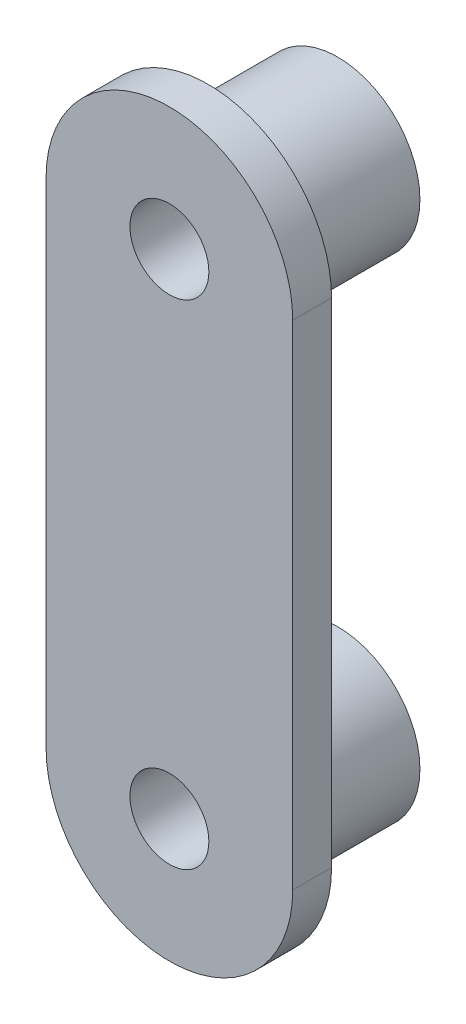
ISO-10303-21;
HEADER;
FILE_DESCRIPTION(('STEP AP214'),'2;1');
FILE_NAME('part.step','',(''),(''),'','','');
FILE_SCHEMA(('AUTOMOTIVE_DESIGN { 1 0 10303 214 1 1 1 1 }'));
ENDSEC;
DATA;
#1=APPLICATION_CONTEXT('core data for automotive mechanical design processes');
#2=APPLICATION_PROTOCOL_DEFINITION('international standard','automotive_design',2000,#1);
#3=PRODUCT_CONTEXT('',#1,'mechanical');
#4=PRODUCT('Part','Part','',(#3));
#5=PRODUCT_RELATED_PRODUCT_CATEGORY('part','',(#4));
#6=PRODUCT_DEFINITION_FORMATION('','',#4);
#7=PRODUCT_DEFINITION_CONTEXT('part definition',#1,'design');
#8=PRODUCT_DEFINITION('design','',#6,#7);
#9=PRODUCT_DEFINITION_SHAPE('','',#8);
#10=(LENGTH_UNIT() NAMED_UNIT(*) SI_UNIT(.MILLI.,.METRE.));
#11=(NAMED_UNIT(*) PLANE_ANGLE_UNIT() SI_UNIT($,.RADIAN.));
#12=(NAMED_UNIT(*) SI_UNIT($,.STERADIAN.) SOLID_ANGLE_UNIT());
#13=UNCERTAINTY_MEASURE_WITH_UNIT(LENGTH_MEASURE(1.E-05),#10,'distance_accuracy_value','');
#14=(GEOMETRIC_REPRESENTATION_CONTEXT(3) GLOBAL_UNCERTAINTY_ASSIGNED_CONTEXT((#13)) GLOBAL_UNIT_ASSIGNED_CONTEXT((#10,
#11,#12)) REPRESENTATION_CONTEXT('',''));
#15=CARTESIAN_POINT('',(0.,0.,0.));
#16=DIRECTION('',(0.,0.,1.));
#17=DIRECTION('',(1.,0.,0.));
#18=AXIS2_PLACEMENT_3D('',#15,#16,#17);
#19=CARTESIAN_POINT('',(0.,0.,1.5));
#20=DIRECTION('',(1.,0.,0.));
#21=DIRECTION('',(0.,1.,0.));
#22=AXIS2_PLACEMENT_3D('',#19,#20,#21);
#23=PLANE('',#22);
#24=DIRECTION('',(0.,-1.,0.));
#25=VECTOR('',#24,1.);
#26=CARTESIAN_POINT('',(0.,0.,0.));
#27=LINE('',#26,#25);
#28=CARTESIAN_POINT('',(0.,0.,0.));
#29=VERTEX_POINT('',#28);
#30=CARTESIAN_POINT('',(0.,-19.05,0.));
#31=VERTEX_POINT('',#30);
#32=EDGE_CURVE('E103',#29,#31,#27,.T.);
#33=ORIENTED_EDGE('',*,*,#32,.T.);
#34=DIRECTION('',(0.,0.,-1.));
#35=VECTOR('',#34,1.);
#36=CARTESIAN_POINT('',(0.,-19.05,1.5));
#37=LINE('',#36,#35);
#38=CARTESIAN_POINT('',(0.,-19.05,1.5));
#39=VERTEX_POINT('',#38);
#40=EDGE_CURVE('E11',#39,#31,#37,.T.);
#41=ORIENTED_EDGE('',*,*,#40,.F.);
#42=DIRECTION('',(0.,-1.,0.));
#43=VECTOR('',#42,1.);
#44=CARTESIAN_POINT('',(0.,0.,1.5));
#45=LINE('',#44,#43);
#46=CARTESIAN_POINT('',(0.,0.,1.5));
#47=VERTEX_POINT('',#46);
#48=EDGE_CURVE('E82',#47,#39,#45,.T.);
#49=ORIENTED_EDGE('',*,*,#48,.F.);
#50=DIRECTION('',(0.,0.,-1.));
#51=VECTOR('',#50,1.);
#52=CARTESIAN_POINT('',(0.,0.,1.5));
#53=LINE('',#52,#51);
#54=EDGE_CURVE('E102',#47,#29,#53,.T.);
#55=ORIENTED_EDGE('',*,*,#54,.T.);
#56=EDGE_LOOP('',(#33,#41,#49,#55));
#57=FACE_BOUND('',#56,.T.);
#58=ADVANCED_FACE('F34',(#57),#23,.F.);
#59=CARTESIAN_POINT('',(4.7625,-19.05,1.5));
#60=DIRECTION('',(0.,0.,-1.));
#61=DIRECTION('',(-1.,0.,0.));
#62=AXIS2_PLACEMENT_3D('',#59,#60,#61);
#63=CYLINDRICAL_SURFACE('',#62,4.7625);
#64=CARTESIAN_POINT('',(4.7625,-19.05,0.));
#65=DIRECTION('',(0.,0.,1.));
#66=DIRECTION('',(1.,0.,0.));
#67=AXIS2_PLACEMENT_3D('',#64,#65,#66);
#68=CIRCLE('',#67,4.7625);
#69=CARTESIAN_POINT('',(9.52500000000001,-19.05,0.));
#70=VERTEX_POINT('',#69);
#71=EDGE_CURVE('E87',#31,#70,#68,.T.);
#72=ORIENTED_EDGE('',*,*,#71,.T.);
#73=DIRECTION('',(0.,0.,-1.));
#74=VECTOR('',#73,1.);
#75=CARTESIAN_POINT('',(9.52500000000001,-19.05,1.5));
#76=LINE('',#75,#74);
#77=CARTESIAN_POINT('',(9.52500000000001,-19.05,1.5));
#78=VERTEX_POINT('',#77);
#79=EDGE_CURVE('E42',#78,#70,#76,.T.);
#80=ORIENTED_EDGE('',*,*,#79,.F.);
#81=CARTESIAN_POINT('',(4.7625,-19.05,1.5));
#82=DIRECTION('',(0.,0.,1.));
#83=DIRECTION('',(1.,0.,0.));
#84=AXIS2_PLACEMENT_3D('',#81,#82,#83);
#85=CIRCLE('',#84,4.7625);
#86=EDGE_CURVE('E76',#39,#78,#85,.T.);
#87=ORIENTED_EDGE('',*,*,#86,.F.);
#88=ORIENTED_EDGE('',*,*,#40,.T.);
#89=EDGE_LOOP('',(#72,#80,#87,#88));
#90=FACE_BOUND('',#89,.T.);
#91=ADVANCED_FACE('F86',(#90),#63,.T.);
#92=CARTESIAN_POINT('',(9.525,0.,1.5));
#93=DIRECTION('',(1.,0.,0.));
#94=DIRECTION('',(0.,1.,0.));
#95=AXIS2_PLACEMENT_3D('',#92,#93,#94);
#96=PLANE('',#95);
#97=DIRECTION('',(0.,-1.,0.));
#98=VECTOR('',#97,1.);
#99=CARTESIAN_POINT('',(9.525,0.,0.));
#100=LINE('',#99,#98);
#101=CARTESIAN_POINT('',(9.525,0.,0.));
#102=VERTEX_POINT('',#101);
#103=EDGE_CURVE('E108',#102,#70,#100,.T.);
#104=ORIENTED_EDGE('',*,*,#103,.F.);
#105=DIRECTION('',(0.,0.,-1.));
#106=VECTOR('',#105,1.);
#107=CARTESIAN_POINT('',(9.525,0.,1.5));
#108=LINE('',#107,#106);
#109=CARTESIAN_POINT('',(9.525,0.,1.5));
#110=VERTEX_POINT('',#109);
#111=EDGE_CURVE('E66',#110,#102,#108,.T.);
#112=ORIENTED_EDGE('',*,*,#111,.F.);
#113=DIRECTION('',(0.,-1.,0.));
#114=VECTOR('',#113,1.);
#115=CARTESIAN_POINT('',(9.525,0.,1.5));
#116=LINE('',#115,#114);
#117=EDGE_CURVE('E80',#110,#78,#116,.T.);
#118=ORIENTED_EDGE('',*,*,#117,.T.);
#119=ORIENTED_EDGE('',*,*,#79,.T.);
#120=EDGE_LOOP('',(#104,#112,#118,#119));
#121=FACE_BOUND('',#120,.T.);
#122=ADVANCED_FACE('F91',(#121),#96,.T.);
#123=CARTESIAN_POINT('',(4.7625,0.,1.5));
#124=DIRECTION('',(0.,0.,-1.));
#125=DIRECTION('',(-1.,0.,0.));
#126=AXIS2_PLACEMENT_3D('',#123,#124,#125);
#127=CYLINDRICAL_SURFACE('',#126,1.524);
#128=CARTESIAN_POINT('',(4.7625,0.,1.5));
#129=DIRECTION('',(0.,0.,1.));
#130=DIRECTION('',(1.,0.,0.));
#131=AXIS2_PLACEMENT_3D('',#128,#129,#130);
#132=CIRCLE('',#131,1.524);
#133=CARTESIAN_POINT('',(6.2865,0.,1.5));
#134=VERTEX_POINT('',#133);
#135=EDGE_CURVE('E93',#134,#134,#132,.T.);
#136=ORIENTED_EDGE('',*,*,#135,.T.);
#137=EDGE_LOOP('',(#136));
#138=FACE_BOUND('',#137,.T.);
#139=CARTESIAN_POINT('',(4.7625,0.,-5.));
#140=DIRECTION('',(0.,0.,1.));
#141=DIRECTION('',(1.,0.,0.));
#142=AXIS2_PLACEMENT_3D('',#139,#140,#141);
#143=CIRCLE('',#142,1.524);
#144=CARTESIAN_POINT('',(6.2865,0.,-5.));
#145=VERTEX_POINT('',#144);
#146=EDGE_CURVE('E106',#145,#145,#143,.T.);
#147=ORIENTED_EDGE('',*,*,#146,.F.);
#148=EDGE_LOOP('',(#147));
#149=FACE_BOUND('',#148,.T.);
#150=ADVANCED_FACE('F139',(#138,#149),#127,.F.);
#151=CARTESIAN_POINT('',(4.7625,0.,1.5));
#152=DIRECTION('',(0.,0.,-1.));
#153=DIRECTION('',(-1.,0.,0.));
#154=AXIS2_PLACEMENT_3D('',#151,#152,#153);
#155=CYLINDRICAL_SURFACE('',#154,4.7625);
#156=CARTESIAN_POINT('',(4.7625,0.,0.));
#157=DIRECTION('',(0.,0.,1.));
#158=DIRECTION('',(1.,0.,0.));
#159=AXIS2_PLACEMENT_3D('',#156,#157,#158);
#160=CIRCLE('',#159,4.7625);
#161=EDGE_CURVE('E69',#102,#29,#160,.T.);
#162=ORIENTED_EDGE('',*,*,#161,.T.);
#163=ORIENTED_EDGE('',*,*,#54,.F.);
#164=CARTESIAN_POINT('',(4.7625,0.,1.5));
#165=DIRECTION('',(0.,0.,1.));
#166=DIRECTION('',(1.,0.,0.));
#167=AXIS2_PLACEMENT_3D('',#164,#165,#166);
#168=CIRCLE('',#167,4.7625);
#169=EDGE_CURVE('E50',#110,#47,#168,.T.);
#170=ORIENTED_EDGE('',*,*,#169,.F.);
#171=ORIENTED_EDGE('',*,*,#111,.T.);
#172=EDGE_LOOP('',(#162,#163,#170,#171));
#173=FACE_BOUND('',#172,.T.);
#174=ADVANCED_FACE('F142',(#173),#155,.T.);
#175=CARTESIAN_POINT('',(4.7625,-19.05,1.5));
#176=DIRECTION('',(0.,0.,-1.));
#177=DIRECTION('',(-1.,0.,0.));
#178=AXIS2_PLACEMENT_3D('',#175,#176,#177);
#179=CYLINDRICAL_SURFACE('',#178,1.524);
#180=CARTESIAN_POINT('',(4.7625,-19.05,1.5));
#181=DIRECTION('',(0.,0.,1.));
#182=DIRECTION('',(1.,0.,0.));
#183=AXIS2_PLACEMENT_3D('',#180,#181,#182);
#184=CIRCLE('',#183,1.524);
#185=CARTESIAN_POINT('',(6.2865,-19.05,1.5));
#186=VERTEX_POINT('',#185);
#187=EDGE_CURVE('E99',#186,#186,#184,.T.);
#188=ORIENTED_EDGE('',*,*,#187,.T.);
#189=EDGE_LOOP('',(#188));
#190=FACE_BOUND('',#189,.T.);
#191=CARTESIAN_POINT('',(4.7625,-19.05,-5.));
#192=DIRECTION('',(0.,0.,1.));
#193=DIRECTION('',(1.,0.,0.));
#194=AXIS2_PLACEMENT_3D('',#191,#192,#193);
#195=CIRCLE('',#194,1.524);
#196=CARTESIAN_POINT('',(6.2865,-19.05,-5.));
#197=VERTEX_POINT('',#196);
#198=EDGE_CURVE('E155',#197,#197,#195,.T.);
#199=ORIENTED_EDGE('',*,*,#198,.F.);
#200=EDGE_LOOP('',(#199));
#201=FACE_BOUND('',#200,.T.);
#202=ADVANCED_FACE('F127',(#190,#201),#179,.F.);
#203=CARTESIAN_POINT('',(0.,0.,1.5));
#204=DIRECTION('',(0.,0.,1.));
#205=DIRECTION('',(1.,0.,0.));
#206=AXIS2_PLACEMENT_3D('',#203,#204,#205);
#207=PLANE('',#206);
#208=ORIENTED_EDGE('',*,*,#48,.T.);
#209=ORIENTED_EDGE('',*,*,#86,.T.);
#210=ORIENTED_EDGE('',*,*,#117,.F.);
#211=ORIENTED_EDGE('',*,*,#169,.T.);
#212=EDGE_LOOP('',(#208,#209,#210,#211));
#213=FACE_BOUND('',#212,.T.);
#214=ORIENTED_EDGE('',*,*,#135,.F.);
#215=EDGE_LOOP('',(#214));
#216=FACE_BOUND('',#215,.T.);
#217=ORIENTED_EDGE('',*,*,#187,.F.);
#218=EDGE_LOOP('',(#217));
#219=FACE_BOUND('',#218,.T.);
#220=ADVANCED_FACE('F77',(#213,#216,#219),#207,.T.);
#221=CARTESIAN_POINT('',(0.,0.,0.));
#222=DIRECTION('',(0.,0.,1.));
#223=DIRECTION('',(1.,0.,0.));
#224=AXIS2_PLACEMENT_3D('',#221,#222,#223);
#225=PLANE('',#224);
#226=CARTESIAN_POINT('',(4.7625,-19.05,0.));
#227=DIRECTION('',(0.,0.,1.));
#228=DIRECTION('',(1.,0.,0.));
#229=AXIS2_PLACEMENT_3D('',#226,#227,#228);
#230=CIRCLE('',#229,3.175);
#231=CARTESIAN_POINT('',(7.93750000000001,-19.05,0.));
#232=VERTEX_POINT('',#231);
#233=EDGE_CURVE('E158',#232,#232,#230,.T.);
#234=ORIENTED_EDGE('',*,*,#233,.T.);
#235=EDGE_LOOP('',(#234));
#236=FACE_BOUND('',#235,.T.);
#237=CARTESIAN_POINT('',(4.7625,0.,0.));
#238=DIRECTION('',(0.,0.,1.));
#239=DIRECTION('',(1.,0.,0.));
#240=AXIS2_PLACEMENT_3D('',#237,#238,#239);
#241=CIRCLE('',#240,3.175);
#242=CARTESIAN_POINT('',(7.9375,0.,0.));
#243=VERTEX_POINT('',#242);
#244=EDGE_CURVE('E161',#243,#243,#241,.T.);
#245=ORIENTED_EDGE('',*,*,#244,.T.);
#246=EDGE_LOOP('',(#245));
#247=FACE_BOUND('',#246,.T.);
#248=ORIENTED_EDGE('',*,*,#32,.F.);
#249=ORIENTED_EDGE('',*,*,#161,.F.);
#250=ORIENTED_EDGE('',*,*,#103,.T.);
#251=ORIENTED_EDGE('',*,*,#71,.F.);
#252=EDGE_LOOP('',(#248,#249,#250,#251));
#253=FACE_BOUND('',#252,.T.);
#254=ADVANCED_FACE('F115',(#236,#247,#253),#225,.F.);
#255=CARTESIAN_POINT('',(4.7625,0.,-5.));
#256=DIRECTION('',(0.,0.,1.));
#257=DIRECTION('',(1.,0.,0.));
#258=AXIS2_PLACEMENT_3D('',#255,#256,#257);
#259=CYLINDRICAL_SURFACE('',#258,3.175);
#260=CARTESIAN_POINT('',(4.7625,0.,-5.));
#261=DIRECTION('',(0.,0.,1.));
#262=DIRECTION('',(1.,0.,0.));
#263=AXIS2_PLACEMENT_3D('',#260,#261,#262);
#264=CIRCLE('',#263,3.175);
#265=CARTESIAN_POINT('',(7.9375,0.,-5.));
#266=VERTEX_POINT('',#265);
#267=EDGE_CURVE('E165',#266,#266,#264,.T.);
#268=ORIENTED_EDGE('',*,*,#267,.T.);
#269=EDGE_LOOP('',(#268));
#270=FACE_BOUND('',#269,.T.);
#271=ORIENTED_EDGE('',*,*,#244,.F.);
#272=EDGE_LOOP('',(#271));
#273=FACE_BOUND('',#272,.T.);
#274=ADVANCED_FACE('F117',(#270,#273),#259,.T.);
#275=CARTESIAN_POINT('',(0.,0.,-5.));
#276=DIRECTION('',(0.,0.,1.));
#277=DIRECTION('',(1.,0.,0.));
#278=AXIS2_PLACEMENT_3D('',#275,#276,#277);
#279=PLANE('',#278);
#280=ORIENTED_EDGE('',*,*,#267,.F.);
#281=EDGE_LOOP('',(#280));
#282=FACE_BOUND('',#281,.T.);
#283=ORIENTED_EDGE('',*,*,#146,.T.);
#284=EDGE_LOOP('',(#283));
#285=FACE_BOUND('',#284,.T.);
#286=ADVANCED_FACE('F124',(#282,#285),#279,.F.);
#287=CARTESIAN_POINT('',(4.7625,-19.05,-5.));
#288=DIRECTION('',(0.,0.,1.));
#289=DIRECTION('',(1.,0.,0.));
#290=AXIS2_PLACEMENT_3D('',#287,#288,#289);
#291=CYLINDRICAL_SURFACE('',#290,3.175);
#292=CARTESIAN_POINT('',(4.7625,-19.05,-5.));
#293=DIRECTION('',(0.,0.,1.));
#294=DIRECTION('',(1.,0.,0.));
#295=AXIS2_PLACEMENT_3D('',#292,#293,#294);
#296=CIRCLE('',#295,3.175);
#297=CARTESIAN_POINT('',(7.93750000000001,-19.05,-5.));
#298=VERTEX_POINT('',#297);
#299=EDGE_CURVE('E157',#298,#298,#296,.T.);
#300=ORIENTED_EDGE('',*,*,#299,.T.);
#301=EDGE_LOOP('',(#300));
#302=FACE_BOUND('',#301,.T.);
#303=ORIENTED_EDGE('',*,*,#233,.F.);
#304=EDGE_LOOP('',(#303));
#305=FACE_BOUND('',#304,.T.);
#306=ADVANCED_FACE('F177',(#302,#305),#291,.T.);
#307=CARTESIAN_POINT('',(0.,0.,-5.));
#308=DIRECTION('',(0.,0.,1.));
#309=DIRECTION('',(1.,0.,0.));
#310=AXIS2_PLACEMENT_3D('',#307,#308,#309);
#311=PLANE('',#310);
#312=ORIENTED_EDGE('',*,*,#198,.T.);
#313=EDGE_LOOP('',(#312));
#314=FACE_BOUND('',#313,.T.);
#315=ORIENTED_EDGE('',*,*,#299,.F.);
#316=EDGE_LOOP('',(#315));
#317=FACE_BOUND('',#316,.T.);
#318=ADVANCED_FACE('F183',(#314,#317),#311,.F.);
#319=CLOSED_SHELL('',(#58,#91,#122,#150,#174,#202,#220,#254,#274,#286,#306,#318));
#320=MANIFOLD_SOLID_BREP('B2',#319);
#321=ADVANCED_BREP_SHAPE_REPRESENTATION('',(#18,#320),#14);
#322=SHAPE_DEFINITION_REPRESENTATION(#9,#321);
ENDSEC;
END-ISO-10303-21;
